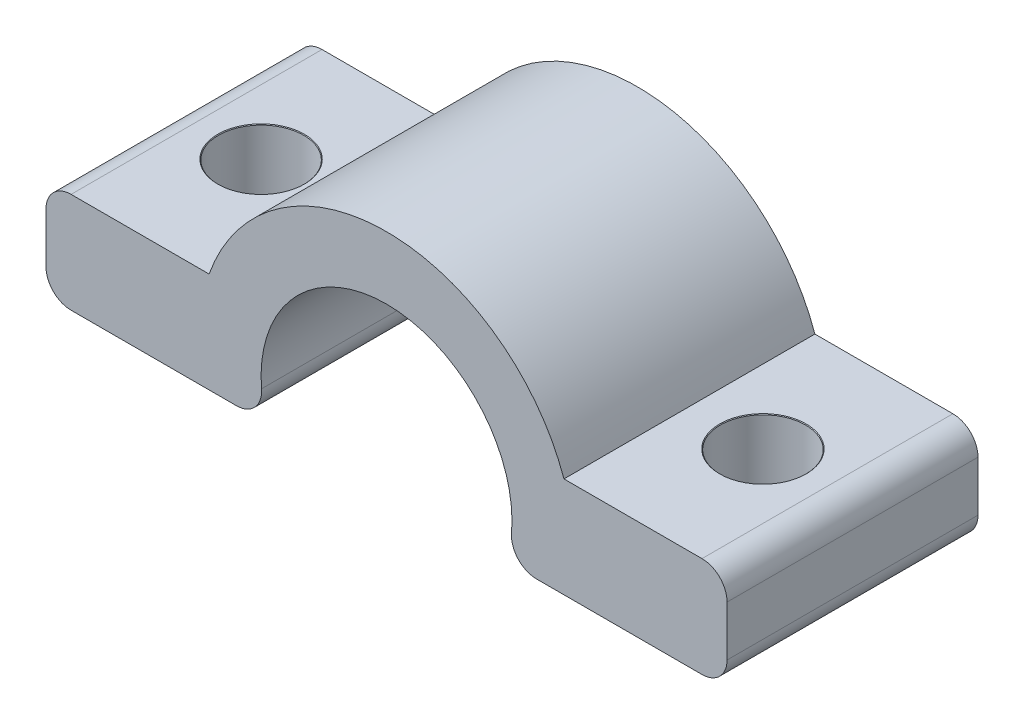
ISO-10303-21;
HEADER;
FILE_DESCRIPTION(('STEP AP214'),'2;1');
FILE_NAME('part.step','',(''),(''),'','','');
FILE_SCHEMA(('AUTOMOTIVE_DESIGN { 1 0 10303 214 1 1 1 1 }'));
ENDSEC;
DATA;
#1=APPLICATION_CONTEXT('core data for automotive mechanical design processes');
#2=APPLICATION_PROTOCOL_DEFINITION('international standard','automotive_design',2000,#1);
#3=PRODUCT_CONTEXT('',#1,'mechanical');
#4=PRODUCT('Part','Part','',(#3));
#5=PRODUCT_RELATED_PRODUCT_CATEGORY('part','',(#4));
#6=PRODUCT_DEFINITION_FORMATION('','',#4);
#7=PRODUCT_DEFINITION_CONTEXT('part definition',#1,'design');
#8=PRODUCT_DEFINITION('design','',#6,#7);
#9=PRODUCT_DEFINITION_SHAPE('','',#8);
#10=(LENGTH_UNIT() NAMED_UNIT(*) SI_UNIT(.MILLI.,.METRE.));
#11=(NAMED_UNIT(*) PLANE_ANGLE_UNIT() SI_UNIT($,.RADIAN.));
#12=(NAMED_UNIT(*) SI_UNIT($,.STERADIAN.) SOLID_ANGLE_UNIT());
#13=UNCERTAINTY_MEASURE_WITH_UNIT(LENGTH_MEASURE(1.E-05),#10,'distance_accuracy_value','');
#14=(GEOMETRIC_REPRESENTATION_CONTEXT(3) GLOBAL_UNCERTAINTY_ASSIGNED_CONTEXT((#13)) GLOBAL_UNIT_ASSIGNED_CONTEXT((#10,
#11,#12)) REPRESENTATION_CONTEXT('',''));
#15=CARTESIAN_POINT('',(0.,0.,0.));
#16=DIRECTION('',(0.,0.,1.));
#17=DIRECTION('',(1.,0.,0.));
#18=AXIS2_PLACEMENT_3D('',#15,#16,#17);
#19=CARTESIAN_POINT('',(0.,0.,10.));
#20=DIRECTION('',(0.,0.,-1.));
#21=DIRECTION('',(-1.,0.,0.));
#22=AXIS2_PLACEMENT_3D('',#19,#20,#21);
#23=CYLINDRICAL_SURFACE('',#22,7.5);
#24=CARTESIAN_POINT('',(0.,0.,0.));
#25=DIRECTION('',(0.,0.,1.));
#26=DIRECTION('',(1.,0.,0.));
#27=AXIS2_PLACEMENT_3D('',#24,#25,#26);
#28=CIRCLE('',#27,7.5);
#29=CARTESIAN_POINT('',(7.07106781186548,2.5,0.));
#30=VERTEX_POINT('',#29);
#31=CARTESIAN_POINT('',(-7.07106781186548,2.5,0.));
#32=VERTEX_POINT('',#31);
#33=EDGE_CURVE('E170',#30,#32,#28,.T.);
#34=ORIENTED_EDGE('',*,*,#33,.T.);
#35=DIRECTION('',(0.,0.,-1.));
#36=VECTOR('',#35,1.);
#37=CARTESIAN_POINT('',(-7.07106781186548,2.5,10.));
#38=LINE('',#37,#36);
#39=CARTESIAN_POINT('',(-7.07106781186548,2.5,10.));
#40=VERTEX_POINT('',#39);
#41=EDGE_CURVE('E151',#40,#32,#38,.T.);
#42=ORIENTED_EDGE('',*,*,#41,.F.);
#43=CARTESIAN_POINT('',(0.,0.,10.));
#44=DIRECTION('',(0.,0.,1.));
#45=DIRECTION('',(1.,0.,0.));
#46=AXIS2_PLACEMENT_3D('',#43,#44,#45);
#47=CIRCLE('',#46,7.5);
#48=CARTESIAN_POINT('',(7.07106781186548,2.5,10.));
#49=VERTEX_POINT('',#48);
#50=EDGE_CURVE('E157',#49,#40,#47,.T.);
#51=ORIENTED_EDGE('',*,*,#50,.F.);
#52=DIRECTION('',(0.,0.,-1.));
#53=VECTOR('',#52,1.);
#54=CARTESIAN_POINT('',(7.07106781186548,2.5,10.));
#55=LINE('',#54,#53);
#56=EDGE_CURVE('E173',#49,#30,#55,.T.);
#57=ORIENTED_EDGE('',*,*,#56,.T.);
#58=EDGE_LOOP('',(#34,#42,#51,#57));
#59=FACE_BOUND('',#58,.T.);
#60=ADVANCED_FACE('F43',(#59),#23,.T.);
#61=CARTESIAN_POINT('',(-7.07106781186548,2.5,10.));
#62=DIRECTION('',(0.,-1.,0.));
#63=DIRECTION('',(1.,0.,0.));
#64=AXIS2_PLACEMENT_3D('',#61,#62,#63);
#65=PLANE('',#64);
#66=CARTESIAN_POINT('',(-10.,2.5,5.));
#67=DIRECTION('',(0.,1.,0.));
#68=DIRECTION('',(0.,0.,1.));
#69=AXIS2_PLACEMENT_3D('',#66,#67,#68);
#70=CIRCLE('',#69,1.725);
#71=CARTESIAN_POINT('',(-10.,2.5,6.725));
#72=VERTEX_POINT('',#71);
#73=EDGE_CURVE('E336',#72,#72,#70,.T.);
#74=ORIENTED_EDGE('',*,*,#73,.F.);
#75=EDGE_LOOP('',(#74));
#76=FACE_BOUND('',#75,.T.);
#77=DIRECTION('',(-1.,0.,0.));
#78=VECTOR('',#77,1.);
#79=CARTESIAN_POINT('',(-7.07106781186548,2.5,0.));
#80=LINE('',#79,#78);
#81=CARTESIAN_POINT('',(-12.5710678118655,2.5,0.));
#82=VERTEX_POINT('',#81);
#83=EDGE_CURVE('E284',#32,#82,#80,.T.);
#84=ORIENTED_EDGE('',*,*,#83,.T.);
#85=DIRECTION('',(0.,0.,-1.));
#86=VECTOR('',#85,1.);
#87=CARTESIAN_POINT('',(-12.5710678118655,2.5,10.));
#88=LINE('',#87,#86);
#89=CARTESIAN_POINT('',(-12.5710678118655,2.5,10.));
#90=VERTEX_POINT('',#89);
#91=EDGE_CURVE('E11',#82,#90,#88,.F.);
#92=ORIENTED_EDGE('',*,*,#91,.T.);
#93=DIRECTION('',(-1.,0.,0.));
#94=VECTOR('',#93,1.);
#95=CARTESIAN_POINT('',(-7.07106781186548,2.5,10.));
#96=LINE('',#95,#94);
#97=EDGE_CURVE('E146',#40,#90,#96,.T.);
#98=ORIENTED_EDGE('',*,*,#97,.F.);
#99=ORIENTED_EDGE('',*,*,#41,.T.);
#100=EDGE_LOOP('',(#84,#92,#98,#99));
#101=FACE_BOUND('',#100,.T.);
#102=ADVANCED_FACE('F149',(#76,#101),#65,.F.);
#103=CARTESIAN_POINT('',(-13.5710678118655,2.5,10.));
#104=DIRECTION('',(1.,0.,0.));
#105=DIRECTION('',(0.,1.,0.));
#106=AXIS2_PLACEMENT_3D('',#103,#104,#105);
#107=PLANE('',#106);
#108=DIRECTION('',(0.,-1.,0.));
#109=VECTOR('',#108,1.);
#110=CARTESIAN_POINT('',(-13.5710678118655,2.5,0.));
#111=LINE('',#110,#109);
#112=CARTESIAN_POINT('',(-13.5710678118655,1.5,0.));
#113=VERTEX_POINT('',#112);
#114=CARTESIAN_POINT('',(-13.5710678118655,-0.500000000000002,0.));
#115=VERTEX_POINT('',#114);
#116=EDGE_CURVE('E256',#113,#115,#111,.T.);
#117=ORIENTED_EDGE('',*,*,#116,.T.);
#118=DIRECTION('',(0.,0.,-1.));
#119=VECTOR('',#118,1.);
#120=CARTESIAN_POINT('',(-13.5710678118655,-0.500000000000002,10.));
#121=LINE('',#120,#119);
#122=CARTESIAN_POINT('',(-13.5710678118655,-0.500000000000002,10.));
#123=VERTEX_POINT('',#122);
#124=EDGE_CURVE('E52',#115,#123,#121,.F.);
#125=ORIENTED_EDGE('',*,*,#124,.T.);
#126=DIRECTION('',(0.,-1.,0.));
#127=VECTOR('',#126,1.);
#128=CARTESIAN_POINT('',(-13.5710678118655,2.5,10.));
#129=LINE('',#128,#127);
#130=CARTESIAN_POINT('',(-13.5710678118655,1.5,10.));
#131=VERTEX_POINT('',#130);
#132=EDGE_CURVE('E156',#131,#123,#129,.T.);
#133=ORIENTED_EDGE('',*,*,#132,.F.);
#134=DIRECTION('',(0.,0.,-1.));
#135=VECTOR('',#134,1.);
#136=CARTESIAN_POINT('',(-13.5710678118655,1.5,10.));
#137=LINE('',#136,#135);
#138=EDGE_CURVE('E244',#131,#113,#137,.T.);
#139=ORIENTED_EDGE('',*,*,#138,.T.);
#140=EDGE_LOOP('',(#117,#125,#133,#139));
#141=FACE_BOUND('',#140,.T.);
#142=ADVANCED_FACE('F253',(#141),#107,.F.);
#143=CARTESIAN_POINT('',(-13.5710678118655,-1.5,10.));
#144=DIRECTION('',(0.,1.,0.));
#145=DIRECTION('',(0.,0.,1.));
#146=AXIS2_PLACEMENT_3D('',#143,#144,#145);
#147=PLANE('',#146);
#148=CARTESIAN_POINT('',(-10.,-1.5,5.));
#149=DIRECTION('',(0.,1.,0.));
#150=DIRECTION('',(0.,0.,1.));
#151=AXIS2_PLACEMENT_3D('',#148,#149,#150);
#152=CIRCLE('',#151,1.7);
#153=CARTESIAN_POINT('',(-10.,-1.5,6.7));
#154=VERTEX_POINT('',#153);
#155=EDGE_CURVE('E328',#154,#154,#152,.T.);
#156=ORIENTED_EDGE('',*,*,#155,.T.);
#157=EDGE_LOOP('',(#156));
#158=FACE_BOUND('',#157,.T.);
#159=DIRECTION('',(1.,0.,0.));
#160=VECTOR('',#159,1.);
#161=CARTESIAN_POINT('',(-13.5710678118655,-1.5,0.));
#162=LINE('',#161,#160);
#163=CARTESIAN_POINT('',(-12.5710678118655,-1.5,0.));
#164=VERTEX_POINT('',#163);
#165=CARTESIAN_POINT('',(-5.9791303715507,-1.5,0.));
#166=VERTEX_POINT('',#165);
#167=EDGE_CURVE('E270',#164,#166,#162,.T.);
#168=ORIENTED_EDGE('',*,*,#167,.T.);
#169=DIRECTION('',(0.,0.,-1.));
#170=VECTOR('',#169,1.);
#171=CARTESIAN_POINT('',(-5.9791303715507,-1.5,10.));
#172=LINE('',#171,#170);
#173=CARTESIAN_POINT('',(-5.9791303715507,-1.5,10.));
#174=VERTEX_POINT('',#173);
#175=EDGE_CURVE('E231',#166,#174,#172,.F.);
#176=ORIENTED_EDGE('',*,*,#175,.T.);
#177=DIRECTION('',(1.,0.,0.));
#178=VECTOR('',#177,1.);
#179=CARTESIAN_POINT('',(-13.5710678118655,-1.5,10.));
#180=LINE('',#179,#178);
#181=CARTESIAN_POINT('',(-12.5710678118655,-1.5,10.));
#182=VERTEX_POINT('',#181);
#183=EDGE_CURVE('E262',#182,#174,#180,.T.);
#184=ORIENTED_EDGE('',*,*,#183,.F.);
#185=DIRECTION('',(0.,0.,-1.));
#186=VECTOR('',#185,1.);
#187=CARTESIAN_POINT('',(-12.5710678118655,-1.5,10.));
#188=LINE('',#187,#186);
#189=EDGE_CURVE('E227',#182,#164,#188,.T.);
#190=ORIENTED_EDGE('',*,*,#189,.T.);
#191=EDGE_LOOP('',(#168,#176,#184,#190));
#192=FACE_BOUND('',#191,.T.);
#193=ADVANCED_FACE('F269',(#158,#192),#147,.F.);
#194=CARTESIAN_POINT('',(0.,0.,10.));
#195=DIRECTION('',(0.,0.,-1.));
#196=DIRECTION('',(-1.,0.,0.));
#197=AXIS2_PLACEMENT_3D('',#194,#195,#196);
#198=CYLINDRICAL_SURFACE('',#197,5.);
#199=CARTESIAN_POINT('',(0.,0.,0.));
#200=DIRECTION('',(0.,0.,-1.));
#201=DIRECTION('',(1.,0.,0.));
#202=AXIS2_PLACEMENT_3D('',#199,#200,#201);
#203=CIRCLE('',#202,5.);
#204=CARTESIAN_POINT('',(-4.98260864295892,-0.416666666666668,0.));
#205=VERTEX_POINT('',#204);
#206=CARTESIAN_POINT('',(4.98260864295892,-0.416666666666668,0.));
#207=VERTEX_POINT('',#206);
#208=EDGE_CURVE('E277',#205,#207,#203,.T.);
#209=ORIENTED_EDGE('',*,*,#208,.T.);
#210=DIRECTION('',(0.,0.,-1.));
#211=VECTOR('',#210,1.);
#212=CARTESIAN_POINT('',(4.98260864295892,-0.416666666666668,10.));
#213=LINE('',#212,#211);
#214=CARTESIAN_POINT('',(4.98260864295892,-0.416666666666668,10.));
#215=VERTEX_POINT('',#214);
#216=EDGE_CURVE('E207',#207,#215,#213,.F.);
#217=ORIENTED_EDGE('',*,*,#216,.T.);
#218=CARTESIAN_POINT('',(0.,0.,10.));
#219=DIRECTION('',(0.,0.,-1.));
#220=DIRECTION('',(1.,0.,0.));
#221=AXIS2_PLACEMENT_3D('',#218,#219,#220);
#222=CIRCLE('',#221,5.);
#223=CARTESIAN_POINT('',(-4.98260864295892,-0.416666666666668,10.));
#224=VERTEX_POINT('',#223);
#225=EDGE_CURVE('E316',#224,#215,#222,.T.);
#226=ORIENTED_EDGE('',*,*,#225,.F.);
#227=DIRECTION('',(0.,0.,-1.));
#228=VECTOR('',#227,1.);
#229=CARTESIAN_POINT('',(-4.98260864295892,-0.416666666666668,10.));
#230=LINE('',#229,#228);
#231=EDGE_CURVE('E203',#224,#205,#230,.T.);
#232=ORIENTED_EDGE('',*,*,#231,.T.);
#233=EDGE_LOOP('',(#209,#217,#226,#232));
#234=FACE_BOUND('',#233,.T.);
#235=ADVANCED_FACE('F462',(#234),#198,.F.);
#236=CARTESIAN_POINT('',(4.76969600708473,-1.5,10.));
#237=DIRECTION('',(0.,1.,0.));
#238=DIRECTION('',(0.,0.,1.));
#239=AXIS2_PLACEMENT_3D('',#236,#237,#238);
#240=PLANE('',#239);
#241=CARTESIAN_POINT('',(10.,-1.5,5.));
#242=DIRECTION('',(0.,1.,0.));
#243=DIRECTION('',(0.,0.,1.));
#244=AXIS2_PLACEMENT_3D('',#241,#242,#243);
#245=CIRCLE('',#244,1.7);
#246=CARTESIAN_POINT('',(10.,-1.5,6.69999999999999));
#247=VERTEX_POINT('',#246);
#248=EDGE_CURVE('E299',#247,#247,#245,.T.);
#249=ORIENTED_EDGE('',*,*,#248,.T.);
#250=EDGE_LOOP('',(#249));
#251=FACE_BOUND('',#250,.T.);
#252=DIRECTION('',(1.,0.,0.));
#253=VECTOR('',#252,1.);
#254=CARTESIAN_POINT('',(4.76969600708473,-1.5,10.));
#255=LINE('',#254,#253);
#256=CARTESIAN_POINT('',(5.9791303715507,-1.5,10.));
#257=VERTEX_POINT('',#256);
#258=CARTESIAN_POINT('',(12.5710678118655,-1.5,10.));
#259=VERTEX_POINT('',#258);
#260=EDGE_CURVE('E312',#257,#259,#255,.T.);
#261=ORIENTED_EDGE('',*,*,#260,.F.);
#262=DIRECTION('',(0.,0.,-1.));
#263=VECTOR('',#262,1.);
#264=CARTESIAN_POINT('',(5.9791303715507,-1.5,10.));
#265=LINE('',#264,#263);
#266=CARTESIAN_POINT('',(5.9791303715507,-1.5,0.));
#267=VERTEX_POINT('',#266);
#268=EDGE_CURVE('E177',#257,#267,#265,.T.);
#269=ORIENTED_EDGE('',*,*,#268,.T.);
#270=DIRECTION('',(1.,0.,0.));
#271=VECTOR('',#270,1.);
#272=CARTESIAN_POINT('',(4.76969600708473,-1.5,0.));
#273=LINE('',#272,#271);
#274=CARTESIAN_POINT('',(12.5710678118655,-1.5,0.));
#275=VERTEX_POINT('',#274);
#276=EDGE_CURVE('E282',#267,#275,#273,.T.);
#277=ORIENTED_EDGE('',*,*,#276,.T.);
#278=DIRECTION('',(0.,0.,-1.));
#279=VECTOR('',#278,1.);
#280=CARTESIAN_POINT('',(12.5710678118655,-1.5,10.));
#281=LINE('',#280,#279);
#282=EDGE_CURVE('E172',#275,#259,#281,.F.);
#283=ORIENTED_EDGE('',*,*,#282,.T.);
#284=EDGE_LOOP('',(#261,#269,#277,#283));
#285=FACE_BOUND('',#284,.T.);
#286=ADVANCED_FACE('F452',(#251,#285),#240,.F.);
#287=CARTESIAN_POINT('',(13.5710678118655,-1.5,10.));
#288=DIRECTION('',(-1.,0.,0.));
#289=DIRECTION('',(0.,-1.,0.));
#290=AXIS2_PLACEMENT_3D('',#287,#288,#289);
#291=PLANE('',#290);
#292=DIRECTION('',(0.,1.,0.));
#293=VECTOR('',#292,1.);
#294=CARTESIAN_POINT('',(13.5710678118655,-1.5,0.));
#295=LINE('',#294,#293);
#296=CARTESIAN_POINT('',(13.5710678118655,-0.500000000000002,0.));
#297=VERTEX_POINT('',#296);
#298=CARTESIAN_POINT('',(13.5710678118655,1.5,0.));
#299=VERTEX_POINT('',#298);
#300=EDGE_CURVE('E291',#297,#299,#295,.T.);
#301=ORIENTED_EDGE('',*,*,#300,.T.);
#302=DIRECTION('',(0.,0.,-1.));
#303=VECTOR('',#302,1.);
#304=CARTESIAN_POINT('',(13.5710678118655,1.5,10.));
#305=LINE('',#304,#303);
#306=CARTESIAN_POINT('',(13.5710678118655,1.5,10.));
#307=VERTEX_POINT('',#306);
#308=EDGE_CURVE('E67',#299,#307,#305,.F.);
#309=ORIENTED_EDGE('',*,*,#308,.T.);
#310=DIRECTION('',(0.,1.,0.));
#311=VECTOR('',#310,1.);
#312=CARTESIAN_POINT('',(13.5710678118655,-1.5,10.));
#313=LINE('',#312,#311);
#314=CARTESIAN_POINT('',(13.5710678118655,-0.500000000000002,10.));
#315=VERTEX_POINT('',#314);
#316=EDGE_CURVE('E309',#315,#307,#313,.T.);
#317=ORIENTED_EDGE('',*,*,#316,.F.);
#318=DIRECTION('',(0.,0.,-1.));
#319=VECTOR('',#318,1.);
#320=CARTESIAN_POINT('',(13.5710678118655,-0.500000000000002,10.));
#321=LINE('',#320,#319);
#322=EDGE_CURVE('E238',#315,#297,#321,.T.);
#323=ORIENTED_EDGE('',*,*,#322,.T.);
#324=EDGE_LOOP('',(#301,#309,#317,#323));
#325=FACE_BOUND('',#324,.T.);
#326=ADVANCED_FACE('F441',(#325),#291,.F.);
#327=CARTESIAN_POINT('',(13.5710678118655,2.5,10.));
#328=DIRECTION('',(0.,-1.,0.));
#329=DIRECTION('',(1.,0.,0.));
#330=AXIS2_PLACEMENT_3D('',#327,#328,#329);
#331=PLANE('',#330);
#332=CARTESIAN_POINT('',(10.,2.5,5.));
#333=DIRECTION('',(0.,1.,0.));
#334=DIRECTION('',(0.,0.,1.));
#335=AXIS2_PLACEMENT_3D('',#332,#333,#334);
#336=CIRCLE('',#335,1.725);
#337=CARTESIAN_POINT('',(10.,2.5,6.725));
#338=VERTEX_POINT('',#337);
#339=EDGE_CURVE('E324',#338,#338,#336,.T.);
#340=ORIENTED_EDGE('',*,*,#339,.F.);
#341=EDGE_LOOP('',(#340));
#342=FACE_BOUND('',#341,.T.);
#343=DIRECTION('',(-1.,0.,0.));
#344=VECTOR('',#343,1.);
#345=CARTESIAN_POINT('',(13.5710678118655,2.5,10.));
#346=LINE('',#345,#344);
#347=CARTESIAN_POINT('',(12.5710678118655,2.5,10.));
#348=VERTEX_POINT('',#347);
#349=EDGE_CURVE('E162',#348,#49,#346,.T.);
#350=ORIENTED_EDGE('',*,*,#349,.F.);
#351=DIRECTION('',(0.,0.,-1.));
#352=VECTOR('',#351,1.);
#353=CARTESIAN_POINT('',(12.5710678118655,2.5,10.));
#354=LINE('',#353,#352);
#355=CARTESIAN_POINT('',(12.5710678118655,2.5,0.));
#356=VERTEX_POINT('',#355);
#357=EDGE_CURVE('E234',#348,#356,#354,.T.);
#358=ORIENTED_EDGE('',*,*,#357,.T.);
#359=DIRECTION('',(-1.,0.,0.));
#360=VECTOR('',#359,1.);
#361=CARTESIAN_POINT('',(13.5710678118655,2.5,0.));
#362=LINE('',#361,#360);
#363=EDGE_CURVE('E167',#356,#30,#362,.T.);
#364=ORIENTED_EDGE('',*,*,#363,.T.);
#365=ORIENTED_EDGE('',*,*,#56,.F.);
#366=EDGE_LOOP('',(#350,#358,#364,#365));
#367=FACE_BOUND('',#366,.T.);
#368=ADVANCED_FACE('F296',(#342,#367),#331,.F.);
#369=CARTESIAN_POINT('',(0.,0.,10.));
#370=DIRECTION('',(0.,0.,1.));
#371=DIRECTION('',(1.,0.,0.));
#372=AXIS2_PLACEMENT_3D('',#369,#370,#371);
#373=PLANE('',#372);
#374=ORIENTED_EDGE('',*,*,#225,.T.);
#375=CARTESIAN_POINT('',(5.9791303715507,-0.500000000000002,10.));
#376=DIRECTION('',(0.,0.,1.));
#377=DIRECTION('',(1.,0.,0.));
#378=AXIS2_PLACEMENT_3D('',#375,#376,#377);
#379=CIRCLE('',#378,1.);
#380=EDGE_CURVE('E224',#215,#257,#379,.T.);
#381=ORIENTED_EDGE('',*,*,#380,.T.);
#382=ORIENTED_EDGE('',*,*,#260,.T.);
#383=CARTESIAN_POINT('',(12.5710678118655,-0.500000000000002,10.));
#384=DIRECTION('',(0.,0.,1.));
#385=DIRECTION('',(1.,0.,0.));
#386=AXIS2_PLACEMENT_3D('',#383,#384,#385);
#387=CIRCLE('',#386,1.);
#388=EDGE_CURVE('E216',#259,#315,#387,.T.);
#389=ORIENTED_EDGE('',*,*,#388,.T.);
#390=ORIENTED_EDGE('',*,*,#316,.T.);
#391=CARTESIAN_POINT('',(12.5710678118655,1.5,10.));
#392=DIRECTION('',(0.,0.,1.));
#393=DIRECTION('',(1.,0.,0.));
#394=AXIS2_PLACEMENT_3D('',#391,#392,#393);
#395=CIRCLE('',#394,1.);
#396=EDGE_CURVE('E59',#307,#348,#395,.T.);
#397=ORIENTED_EDGE('',*,*,#396,.T.);
#398=ORIENTED_EDGE('',*,*,#349,.T.);
#399=ORIENTED_EDGE('',*,*,#50,.T.);
#400=ORIENTED_EDGE('',*,*,#97,.T.);
#401=CARTESIAN_POINT('',(-12.5710678118655,1.5,10.));
#402=DIRECTION('',(0.,0.,1.));
#403=DIRECTION('',(1.,0.,0.));
#404=AXIS2_PLACEMENT_3D('',#401,#402,#403);
#405=CIRCLE('',#404,1.);
#406=EDGE_CURVE('E210',#90,#131,#405,.T.);
#407=ORIENTED_EDGE('',*,*,#406,.T.);
#408=ORIENTED_EDGE('',*,*,#132,.T.);
#409=CARTESIAN_POINT('',(-12.5710678118655,-0.500000000000002,10.));
#410=DIRECTION('',(0.,0.,1.));
#411=DIRECTION('',(1.,0.,0.));
#412=AXIS2_PLACEMENT_3D('',#409,#410,#411);
#413=CIRCLE('',#412,1.);
#414=EDGE_CURVE('E213',#123,#182,#413,.T.);
#415=ORIENTED_EDGE('',*,*,#414,.T.);
#416=ORIENTED_EDGE('',*,*,#183,.T.);
#417=CARTESIAN_POINT('',(-5.9791303715507,-0.500000000000002,10.));
#418=DIRECTION('',(0.,0.,1.));
#419=DIRECTION('',(1.,0.,0.));
#420=AXIS2_PLACEMENT_3D('',#417,#418,#419);
#421=CIRCLE('',#420,1.);
#422=EDGE_CURVE('E221',#174,#224,#421,.T.);
#423=ORIENTED_EDGE('',*,*,#422,.T.);
#424=EDGE_LOOP('',(#374,#381,#382,#389,#390,#397,#398,#399,#400,#407,#408,#415,#416,#423));
#425=FACE_BOUND('',#424,.T.);
#426=ADVANCED_FACE('F161',(#425),#373,.T.);
#427=CARTESIAN_POINT('',(0.,0.,0.));
#428=DIRECTION('',(0.,0.,1.));
#429=DIRECTION('',(1.,0.,0.));
#430=AXIS2_PLACEMENT_3D('',#427,#428,#429);
#431=PLANE('',#430);
#432=ORIENTED_EDGE('',*,*,#276,.F.);
#433=CARTESIAN_POINT('',(5.9791303715507,-0.500000000000002,0.));
#434=DIRECTION('',(0.,0.,1.));
#435=DIRECTION('',(1.,0.,0.));
#436=AXIS2_PLACEMENT_3D('',#433,#434,#435);
#437=CIRCLE('',#436,1.);
#438=EDGE_CURVE('E200',#267,#207,#437,.F.);
#439=ORIENTED_EDGE('',*,*,#438,.T.);
#440=ORIENTED_EDGE('',*,*,#208,.F.);
#441=CARTESIAN_POINT('',(-5.9791303715507,-0.500000000000002,0.));
#442=DIRECTION('',(0.,0.,1.));
#443=DIRECTION('',(1.,0.,0.));
#444=AXIS2_PLACEMENT_3D('',#441,#442,#443);
#445=CIRCLE('',#444,1.);
#446=EDGE_CURVE('E197',#205,#166,#445,.F.);
#447=ORIENTED_EDGE('',*,*,#446,.T.);
#448=ORIENTED_EDGE('',*,*,#167,.F.);
#449=CARTESIAN_POINT('',(-12.5710678118655,-0.500000000000002,0.));
#450=DIRECTION('',(0.,0.,1.));
#451=DIRECTION('',(1.,0.,0.));
#452=AXIS2_PLACEMENT_3D('',#449,#450,#451);
#453=CIRCLE('',#452,1.);
#454=EDGE_CURVE('E188',#164,#115,#453,.F.);
#455=ORIENTED_EDGE('',*,*,#454,.T.);
#456=ORIENTED_EDGE('',*,*,#116,.F.);
#457=CARTESIAN_POINT('',(-12.5710678118655,1.5,0.));
#458=DIRECTION('',(0.,0.,1.));
#459=DIRECTION('',(1.,0.,0.));
#460=AXIS2_PLACEMENT_3D('',#457,#458,#459);
#461=CIRCLE('',#460,1.);
#462=EDGE_CURVE('E185',#113,#82,#461,.F.);
#463=ORIENTED_EDGE('',*,*,#462,.T.);
#464=ORIENTED_EDGE('',*,*,#83,.F.);
#465=ORIENTED_EDGE('',*,*,#33,.F.);
#466=ORIENTED_EDGE('',*,*,#363,.F.);
#467=CARTESIAN_POINT('',(12.5710678118655,1.5,0.));
#468=DIRECTION('',(0.,0.,1.));
#469=DIRECTION('',(1.,0.,0.));
#470=AXIS2_PLACEMENT_3D('',#467,#468,#469);
#471=CIRCLE('',#470,1.);
#472=EDGE_CURVE('E194',#356,#299,#471,.F.);
#473=ORIENTED_EDGE('',*,*,#472,.T.);
#474=ORIENTED_EDGE('',*,*,#300,.F.);
#475=CARTESIAN_POINT('',(12.5710678118655,-0.500000000000002,0.));
#476=DIRECTION('',(0.,0.,1.));
#477=DIRECTION('',(1.,0.,0.));
#478=AXIS2_PLACEMENT_3D('',#475,#476,#477);
#479=CIRCLE('',#478,1.);
#480=EDGE_CURVE('E191',#297,#275,#479,.F.);
#481=ORIENTED_EDGE('',*,*,#480,.T.);
#482=EDGE_LOOP('',(#432,#439,#440,#447,#448,#455,#456,#463,#464,#465,#466,#473,#474,#481));
#483=FACE_BOUND('',#482,.T.);
#484=ADVANCED_FACE('F274',(#483),#431,.F.);
#485=CARTESIAN_POINT('',(10.,2.5,5.));
#486=DIRECTION('',(0.,1.,0.));
#487=DIRECTION('',(0.,0.,1.));
#488=AXIS2_PLACEMENT_3D('',#485,#486,#487);
#489=CYLINDRICAL_SURFACE('',#488,1.7);
#490=ORIENTED_EDGE('',*,*,#248,.F.);
#491=EDGE_LOOP('',(#490));
#492=FACE_BOUND('',#491,.T.);
#493=CARTESIAN_POINT('',(10.,2.475,5.));
#494=DIRECTION('',(0.,1.,0.));
#495=DIRECTION('',(0.,0.,1.));
#496=AXIS2_PLACEMENT_3D('',#493,#494,#495);
#497=CIRCLE('',#496,1.7);
#498=CARTESIAN_POINT('',(10.,2.475,6.7));
#499=VERTEX_POINT('',#498);
#500=EDGE_CURVE('E304',#499,#499,#497,.T.);
#501=ORIENTED_EDGE('',*,*,#500,.T.);
#502=EDGE_LOOP('',(#501));
#503=FACE_BOUND('',#502,.T.);
#504=ADVANCED_FACE('F420',(#492,#503),#489,.F.);
#505=CARTESIAN_POINT('',(10.,2.5,5.));
#506=DIRECTION('',(0.,1.,0.));
#507=DIRECTION('',(0.,0.,1.));
#508=AXIS2_PLACEMENT_3D('',#505,#506,#507);
#509=CONICAL_SURFACE('',#508,1.725,0.785398163397448);
#510=ORIENTED_EDGE('',*,*,#500,.F.);
#511=EDGE_LOOP('',(#510));
#512=FACE_BOUND('',#511,.T.);
#513=ORIENTED_EDGE('',*,*,#339,.T.);
#514=EDGE_LOOP('',(#513));
#515=FACE_BOUND('',#514,.T.);
#516=ADVANCED_FACE('F514',(#512,#515),#509,.F.);
#517=CARTESIAN_POINT('',(-10.,2.5,5.));
#518=DIRECTION('',(0.,1.,0.));
#519=DIRECTION('',(0.,0.,1.));
#520=AXIS2_PLACEMENT_3D('',#517,#518,#519);
#521=CYLINDRICAL_SURFACE('',#520,1.7);
#522=ORIENTED_EDGE('',*,*,#155,.F.);
#523=EDGE_LOOP('',(#522));
#524=FACE_BOUND('',#523,.T.);
#525=CARTESIAN_POINT('',(-10.,2.475,5.));
#526=DIRECTION('',(0.,1.,0.));
#527=DIRECTION('',(0.,0.,1.));
#528=AXIS2_PLACEMENT_3D('',#525,#526,#527);
#529=CIRCLE('',#528,1.7);
#530=CARTESIAN_POINT('',(-10.,2.475,6.7));
#531=VERTEX_POINT('',#530);
#532=EDGE_CURVE('E332',#531,#531,#529,.T.);
#533=ORIENTED_EDGE('',*,*,#532,.T.);
#534=EDGE_LOOP('',(#533));
#535=FACE_BOUND('',#534,.T.);
#536=ADVANCED_FACE('F503',(#524,#535),#521,.F.);
#537=CARTESIAN_POINT('',(-10.,2.5,5.));
#538=DIRECTION('',(0.,1.,0.));
#539=DIRECTION('',(0.,0.,1.));
#540=AXIS2_PLACEMENT_3D('',#537,#538,#539);
#541=CONICAL_SURFACE('',#540,1.725,0.785398163397448);
#542=ORIENTED_EDGE('',*,*,#532,.F.);
#543=EDGE_LOOP('',(#542));
#544=FACE_BOUND('',#543,.T.);
#545=ORIENTED_EDGE('',*,*,#73,.T.);
#546=EDGE_LOOP('',(#545));
#547=FACE_BOUND('',#546,.T.);
#548=ADVANCED_FACE('F341',(#544,#547),#541,.F.);
#549=CARTESIAN_POINT('',(5.9791303715507,-0.500000000000002,10.));
#550=DIRECTION('',(0.,0.,-1.));
#551=DIRECTION('',(-1.,0.,0.));
#552=AXIS2_PLACEMENT_3D('',#549,#550,#551);
#553=CYLINDRICAL_SURFACE('',#552,1.);
#554=ORIENTED_EDGE('',*,*,#380,.F.);
#555=ORIENTED_EDGE('',*,*,#216,.F.);
#556=ORIENTED_EDGE('',*,*,#438,.F.);
#557=ORIENTED_EDGE('',*,*,#268,.F.);
#558=EDGE_LOOP('',(#554,#555,#556,#557));
#559=FACE_BOUND('',#558,.T.);
#560=ADVANCED_FACE('F353',(#559),#553,.T.);
#561=CARTESIAN_POINT('',(-5.9791303715507,-0.500000000000002,10.));
#562=DIRECTION('',(0.,0.,-1.));
#563=DIRECTION('',(-1.,0.,0.));
#564=AXIS2_PLACEMENT_3D('',#561,#562,#563);
#565=CYLINDRICAL_SURFACE('',#564,1.);
#566=ORIENTED_EDGE('',*,*,#422,.F.);
#567=ORIENTED_EDGE('',*,*,#175,.F.);
#568=ORIENTED_EDGE('',*,*,#446,.F.);
#569=ORIENTED_EDGE('',*,*,#231,.F.);
#570=EDGE_LOOP('',(#566,#567,#568,#569));
#571=FACE_BOUND('',#570,.T.);
#572=ADVANCED_FACE('F356',(#571),#565,.T.);
#573=CARTESIAN_POINT('',(12.5710678118655,1.5,10.));
#574=DIRECTION('',(0.,0.,-1.));
#575=DIRECTION('',(-1.,0.,0.));
#576=AXIS2_PLACEMENT_3D('',#573,#574,#575);
#577=CYLINDRICAL_SURFACE('',#576,1.);
#578=ORIENTED_EDGE('',*,*,#396,.F.);
#579=ORIENTED_EDGE('',*,*,#308,.F.);
#580=ORIENTED_EDGE('',*,*,#472,.F.);
#581=ORIENTED_EDGE('',*,*,#357,.F.);
#582=EDGE_LOOP('',(#578,#579,#580,#581));
#583=FACE_BOUND('',#582,.T.);
#584=ADVANCED_FACE('F360',(#583),#577,.T.);
#585=CARTESIAN_POINT('',(12.5710678118655,-0.500000000000002,10.));
#586=DIRECTION('',(0.,0.,-1.));
#587=DIRECTION('',(-1.,0.,0.));
#588=AXIS2_PLACEMENT_3D('',#585,#586,#587);
#589=CYLINDRICAL_SURFACE('',#588,1.);
#590=ORIENTED_EDGE('',*,*,#388,.F.);
#591=ORIENTED_EDGE('',*,*,#282,.F.);
#592=ORIENTED_EDGE('',*,*,#480,.F.);
#593=ORIENTED_EDGE('',*,*,#322,.F.);
#594=EDGE_LOOP('',(#590,#591,#592,#593));
#595=FACE_BOUND('',#594,.T.);
#596=ADVANCED_FACE('F364',(#595),#589,.T.);
#597=CARTESIAN_POINT('',(-12.5710678118655,-0.500000000000002,10.));
#598=DIRECTION('',(0.,0.,-1.));
#599=DIRECTION('',(-1.,0.,0.));
#600=AXIS2_PLACEMENT_3D('',#597,#598,#599);
#601=CYLINDRICAL_SURFACE('',#600,1.);
#602=ORIENTED_EDGE('',*,*,#414,.F.);
#603=ORIENTED_EDGE('',*,*,#124,.F.);
#604=ORIENTED_EDGE('',*,*,#454,.F.);
#605=ORIENTED_EDGE('',*,*,#189,.F.);
#606=EDGE_LOOP('',(#602,#603,#604,#605));
#607=FACE_BOUND('',#606,.T.);
#608=ADVANCED_FACE('F265',(#607),#601,.T.);
#609=CARTESIAN_POINT('',(-12.5710678118655,1.5,10.));
#610=DIRECTION('',(0.,0.,-1.));
#611=DIRECTION('',(-1.,0.,0.));
#612=AXIS2_PLACEMENT_3D('',#609,#610,#611);
#613=CYLINDRICAL_SURFACE('',#612,1.);
#614=ORIENTED_EDGE('',*,*,#406,.F.);
#615=ORIENTED_EDGE('',*,*,#91,.F.);
#616=ORIENTED_EDGE('',*,*,#462,.F.);
#617=ORIENTED_EDGE('',*,*,#138,.F.);
#618=EDGE_LOOP('',(#614,#615,#616,#617));
#619=FACE_BOUND('',#618,.T.);
#620=ADVANCED_FACE('F45',(#619),#613,.T.);
#621=CLOSED_SHELL('',(#60,#102,#142,#193,#235,#286,#326,#368,#426,#484,#504,#516,#536,#548,#560,
#572,#584,#596,#608,#620));
#622=MANIFOLD_SOLID_BREP('B2',#621);
#623=ADVANCED_BREP_SHAPE_REPRESENTATION('',(#18,#622),#14);
#624=SHAPE_DEFINITION_REPRESENTATION(#9,#623);
ENDSEC;
END-ISO-10303-21;
